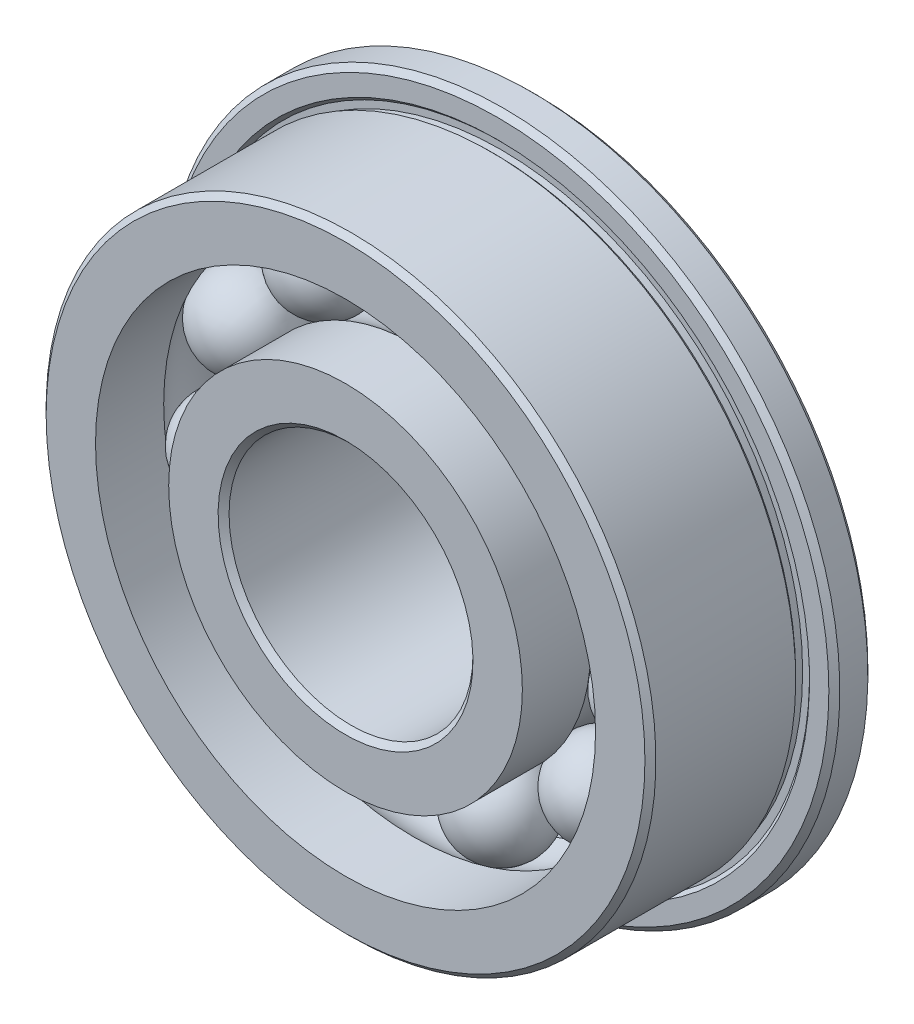
ISO-10303-21;
HEADER;
FILE_DESCRIPTION(('STEP AP214'),'2;1');
FILE_NAME('part.step','',(''),(''),'','','');
FILE_SCHEMA(('AUTOMOTIVE_DESIGN { 1 0 10303 214 1 1 1 1 }'));
ENDSEC;
DATA;
#1=APPLICATION_CONTEXT('core data for automotive mechanical design processes');
#2=APPLICATION_PROTOCOL_DEFINITION('international standard','automotive_design',2000,#1);
#3=PRODUCT_CONTEXT('',#1,'mechanical');
#4=PRODUCT('Part','Part','',(#3));
#5=PRODUCT_RELATED_PRODUCT_CATEGORY('part','',(#4));
#6=PRODUCT_DEFINITION_FORMATION('','',#4);
#7=PRODUCT_DEFINITION_CONTEXT('part definition',#1,'design');
#8=PRODUCT_DEFINITION('design','',#6,#7);
#9=PRODUCT_DEFINITION_SHAPE('','',#8);
#10=(LENGTH_UNIT() NAMED_UNIT(*) SI_UNIT(.MILLI.,.METRE.));
#11=(NAMED_UNIT(*) PLANE_ANGLE_UNIT() SI_UNIT($,.RADIAN.));
#12=(NAMED_UNIT(*) SI_UNIT($,.STERADIAN.) SOLID_ANGLE_UNIT());
#13=UNCERTAINTY_MEASURE_WITH_UNIT(LENGTH_MEASURE(1.E-05),#10,'distance_accuracy_value','');
#14=(GEOMETRIC_REPRESENTATION_CONTEXT(3) GLOBAL_UNCERTAINTY_ASSIGNED_CONTEXT((#13)) GLOBAL_UNIT_ASSIGNED_CONTEXT((#10,
#11,#12)) REPRESENTATION_CONTEXT('',''));
#15=CARTESIAN_POINT('',(0.,0.,0.));
#16=DIRECTION('',(0.,0.,1.));
#17=DIRECTION('',(1.,0.,0.));
#18=AXIS2_PLACEMENT_3D('',#15,#16,#17);
#19=CARTESIAN_POINT('',(-3.0039355419876,4.67421494179329,0.));
#20=DIRECTION('',(-0.540640817455586,0.841253532831188,0.));
#21=DIRECTION('',(0.841253532831188,0.540640817455586,0.));
#22=AXIS2_PLACEMENT_3D('',#19,#20,#21);
#23=SPHERICAL_SURFACE('',#22,1.190625);
#24=CARTESIAN_POINT('',(-3.64763601527066,5.67583242932043,0.));
#25=VERTEX_POINT('',#24);
#26=VERTEX_LOOP('',#25);
#27=FACE_BOUND('',#26,.T.);
#28=ADVANCED_FACE('F45',(#27),#23,.T.);
#29=CLOSED_SHELL('',(#28));
#30=MANIFOLD_SOLID_BREP('B2',#29);
#31=CARTESIAN_POINT('',(-5.05414277418852,2.30814966599179,0.));
#32=DIRECTION('',(-0.909631995354513,0.415415013001897,0.));
#33=DIRECTION('',(0.415415013001897,0.909631995354513,0.));
#34=AXIS2_PLACEMENT_3D('',#31,#32,#33);
#35=SPHERICAL_SURFACE('',#34,1.190625);
#36=CARTESIAN_POINT('',(-6.13717336865748,2.80275316584718,0.));
#37=VERTEX_POINT('',#36);
#38=VERTEX_LOOP('',#37);
#39=FACE_BOUND('',#38,.T.);
#40=ADVANCED_FACE('F65',(#39),#35,.T.);
#41=CLOSED_SHELL('',(#40));
#42=MANIFOLD_SOLID_BREP('B7',#41);
#43=CARTESIAN_POINT('',(-5.49969538645094,-0.790736820155883,0.));
#44=DIRECTION('',(-0.989821441880934,-0.142314838273275,0.));
#45=DIRECTION('',(-0.142314838273275,0.989821441880934,0.));
#46=AXIS2_PLACEMENT_3D('',#43,#44,#45);
#47=SPHERICAL_SURFACE('',#46,1.190625);
#48=CARTESIAN_POINT('',(-6.67820154069043,-0.960180424475,0.));
#49=VERTEX_POINT('',#48);
#50=VERTEX_LOOP('',#49);
#51=FACE_BOUND('',#50,.T.);
#52=ADVANCED_FACE('F85',(#51),#47,.T.);
#53=CLOSED_SHELL('',(#52));
#54=MANIFOLD_SOLID_BREP('B41',#53);
#55=CARTESIAN_POINT('',(-4.19913357250588,-3.63856995298345,0.));
#56=DIRECTION('',(-0.755749574354264,-0.654860733945278,0.));
#57=DIRECTION('',(-0.654860733945278,0.755749574354264,0.));
#58=AXIS2_PLACEMENT_3D('',#55,#56,#57);
#59=SPHERICAL_SURFACE('',#58,1.190625);
#60=CARTESIAN_POINT('',(-5.09894790947143,-4.41826351433705,0.));
#61=VERTEX_POINT('',#60);
#62=VERTEX_LOOP('',#61);
#63=FACE_BOUND('',#62,.T.);
#64=ADVANCED_FACE('F105',(#63),#59,.T.);
#65=CLOSED_SHELL('',(#64));
#66=MANIFOLD_SOLID_BREP('B61',#65);
#67=CARTESIAN_POINT('',(-1.56537651895024,-5.33118283464554,0.));
#68=DIRECTION('',(-0.281732556841437,-0.959492973614495,0.));
#69=DIRECTION('',(-0.959492973614495,0.281732556841437,0.));
#70=AXIS2_PLACEMENT_3D('',#67,#68,#69);
#71=SPHERICAL_SURFACE('',#70,1.190625);
#72=CARTESIAN_POINT('',(-1.90081434443957,-6.4735791563553,0.));
#73=VERTEX_POINT('',#72);
#74=VERTEX_LOOP('',#73);
#75=FACE_BOUND('',#74,.T.);
#76=ADVANCED_FACE('F125',(#75),#71,.T.);
#77=CLOSED_SHELL('',(#76));
#78=MANIFOLD_SOLID_BREP('B81',#77);
#79=CARTESIAN_POINT('',(1.56537651895016,-5.33118283464556,0.));
#80=DIRECTION('',(0.281732556841423,-0.959492973614499,0.));
#81=DIRECTION('',(-0.959492973614499,-0.281732556841423,0.));
#82=AXIS2_PLACEMENT_3D('',#79,#80,#81);
#83=SPHERICAL_SURFACE('',#82,1.190625);
#84=CARTESIAN_POINT('',(1.90081434443948,-6.47357915635533,0.));
#85=VERTEX_POINT('',#84);
#86=VERTEX_LOOP('',#85);
#87=FACE_BOUND('',#86,.T.);
#88=ADVANCED_FACE('F145',(#87),#83,.T.);
#89=CLOSED_SHELL('',(#88));
#90=MANIFOLD_SOLID_BREP('B101',#89);
#91=CARTESIAN_POINT('',(4.19913357250583,-3.63856995298351,0.));
#92=DIRECTION('',(0.755749574354255,-0.654860733945289,0.));
#93=DIRECTION('',(-0.654860733945289,-0.755749574354255,0.));
#94=AXIS2_PLACEMENT_3D('',#91,#92,#93);
#95=SPHERICAL_SURFACE('',#94,1.190625);
#96=CARTESIAN_POINT('',(5.09894790947136,-4.41826351433712,0.));
#97=VERTEX_POINT('',#96);
#98=VERTEX_LOOP('',#97);
#99=FACE_BOUND('',#98,.T.);
#100=ADVANCED_FACE('F165',(#99),#95,.T.);
#101=CLOSED_SHELL('',(#100));
#102=MANIFOLD_SOLID_BREP('B121',#101);
#103=CARTESIAN_POINT('',(5.49969538645093,-0.790736820155962,0.));
#104=DIRECTION('',(0.989821441880932,-0.142314838273289,0.));
#105=DIRECTION('',(-0.142314838273289,-0.989821441880932,0.));
#106=AXIS2_PLACEMENT_3D('',#103,#104,#105);
#107=SPHERICAL_SURFACE('',#106,1.190625);
#108=CARTESIAN_POINT('',(6.67820154069041,-0.960180424475096,0.));
#109=VERTEX_POINT('',#108);
#110=VERTEX_LOOP('',#109);
#111=FACE_BOUND('',#110,.T.);
#112=ADVANCED_FACE('F185',(#111),#107,.T.);
#113=CLOSED_SHELL('',(#112));
#114=MANIFOLD_SOLID_BREP('B141',#113);
#115=CARTESIAN_POINT('',(5.05414277418855,2.30814966599172,0.));
#116=DIRECTION('',(0.909631995354519,0.415415013001884,0.));
#117=DIRECTION('',(0.415415013001884,-0.909631995354519,0.));
#118=AXIS2_PLACEMENT_3D('',#115,#116,#117);
#119=SPHERICAL_SURFACE('',#118,1.190625);
#120=CARTESIAN_POINT('',(6.13717336865752,2.80275316584709,0.));
#121=VERTEX_POINT('',#120);
#122=VERTEX_LOOP('',#121);
#123=FACE_BOUND('',#122,.T.);
#124=ADVANCED_FACE('F205',(#123),#119,.T.);
#125=CLOSED_SHELL('',(#124));
#126=MANIFOLD_SOLID_BREP('B161',#125);
#127=CARTESIAN_POINT('',(3.00393554198767,4.67421494179325,0.));
#128=DIRECTION('',(0.540640817455599,0.841253532831181,0.));
#129=DIRECTION('',(0.841253532831181,-0.540640817455599,0.));
#130=AXIS2_PLACEMENT_3D('',#127,#128,#129);
#131=SPHERICAL_SURFACE('',#130,1.190625);
#132=CARTESIAN_POINT('',(3.64763601527074,5.67583242932037,0.));
#133=VERTEX_POINT('',#132);
#134=VERTEX_LOOP('',#133);
#135=FACE_BOUND('',#134,.T.);
#136=ADVANCED_FACE('F225',(#135),#131,.T.);
#137=CLOSED_SHELL('',(#136));
#138=MANIFOLD_SOLID_BREP('B181',#137);
#139=CARTESIAN_POINT('',(0.,5.55625,0.));
#140=DIRECTION('',(0.,1.,0.));
#141=DIRECTION('',(1.,0.,0.));
#142=AXIS2_PLACEMENT_3D('',#139,#140,#141);
#143=SPHERICAL_SURFACE('',#142,1.190625);
#144=CARTESIAN_POINT('',(0.,6.746875,0.));
#145=VERTEX_POINT('',#144);
#146=VERTEX_LOOP('',#145);
#147=FACE_BOUND('',#146,.T.);
#148=ADVANCED_FACE('F248',(#147),#143,.T.);
#149=CLOSED_SHELL('',(#148));
#150=MANIFOLD_SOLID_BREP('B201',#149);
#151=CARTESIAN_POINT('',(0.,0.,0.));
#152=DIRECTION('',(0.,0.,1.));
#153=DIRECTION('',(0.,-1.,0.));
#154=AXIS2_PLACEMENT_3D('',#151,#152,#153);
#155=CYLINDRICAL_SURFACE('',#154,4.60375);
#156=CARTESIAN_POINT('',(0.,0.,-0.714374999999998));
#157=DIRECTION('',(0.,0.,1.));
#158=DIRECTION('',(0.,-1.,0.));
#159=AXIS2_PLACEMENT_3D('',#156,#157,#158);
#160=CIRCLE('',#159,4.60375);
#161=CARTESIAN_POINT('',(0.,-4.60375,-0.714374999999999));
#162=VERTEX_POINT('',#161);
#163=EDGE_CURVE('E297',#162,#162,#160,.T.);
#164=ORIENTED_EDGE('',*,*,#163,.F.);
#165=EDGE_LOOP('',(#164));
#166=FACE_BOUND('',#165,.T.);
#167=CARTESIAN_POINT('',(0.,0.,-2.4892));
#168=DIRECTION('',(0.,0.,1.));
#169=DIRECTION('',(0.,-1.,0.));
#170=AXIS2_PLACEMENT_3D('',#167,#168,#169);
#171=CIRCLE('',#170,4.60375);
#172=CARTESIAN_POINT('',(0.,-4.60375,-2.4892));
#173=VERTEX_POINT('',#172);
#174=EDGE_CURVE('E309',#173,#173,#171,.T.);
#175=ORIENTED_EDGE('',*,*,#174,.T.);
#176=EDGE_LOOP('',(#175));
#177=FACE_BOUND('',#176,.T.);
#178=ADVANCED_FACE('F271',(#166,#177),#155,.T.);
#179=CARTESIAN_POINT('',(0.,0.,0.));
#180=DIRECTION('',(0.,0.,1.));
#181=DIRECTION('',(0.,-1.,0.));
#182=AXIS2_PLACEMENT_3D('',#179,#180,#181);
#183=TOROIDAL_SURFACE('',#182,5.55625,1.190625);
#184=CARTESIAN_POINT('',(0.,0.,0.714374999999999));
#185=DIRECTION('',(0.,0.,1.));
#186=DIRECTION('',(0.,-1.,0.));
#187=AXIS2_PLACEMENT_3D('',#184,#185,#186);
#188=CIRCLE('',#187,4.60375);
#189=CARTESIAN_POINT('',(0.,-4.60375,0.714374999999998));
#190=VERTEX_POINT('',#189);
#191=EDGE_CURVE('E301',#190,#190,#188,.T.);
#192=ORIENTED_EDGE('',*,*,#191,.F.);
#193=EDGE_LOOP('',(#192));
#194=FACE_BOUND('',#193,.T.);
#195=ORIENTED_EDGE('',*,*,#163,.T.);
#196=EDGE_LOOP('',(#195));
#197=FACE_BOUND('',#196,.T.);
#198=ADVANCED_FACE('F330',(#194,#197),#183,.F.);
#199=CARTESIAN_POINT('',(0.,0.,0.));
#200=DIRECTION('',(0.,0.,1.));
#201=DIRECTION('',(0.,-1.,0.));
#202=AXIS2_PLACEMENT_3D('',#199,#200,#201);
#203=CYLINDRICAL_SURFACE('',#202,4.60375);
#204=CARTESIAN_POINT('',(0.,0.,2.4892));
#205=DIRECTION('',(0.,0.,1.));
#206=DIRECTION('',(0.,-1.,0.));
#207=AXIS2_PLACEMENT_3D('',#204,#205,#206);
#208=CIRCLE('',#207,4.60375);
#209=CARTESIAN_POINT('',(0.,-4.60375,2.4892));
#210=VERTEX_POINT('',#209);
#211=EDGE_CURVE('E305',#210,#210,#208,.T.);
#212=ORIENTED_EDGE('',*,*,#211,.F.);
#213=EDGE_LOOP('',(#212));
#214=FACE_BOUND('',#213,.T.);
#215=ORIENTED_EDGE('',*,*,#191,.T.);
#216=EDGE_LOOP('',(#215));
#217=FACE_BOUND('',#216,.T.);
#218=ADVANCED_FACE('F336',(#214,#217),#203,.T.);
#219=CARTESIAN_POINT('',(0.,3.175,2.4892));
#220=DIRECTION('',(0.,0.,-1.));
#221=DIRECTION('',(0.,1.,0.));
#222=AXIS2_PLACEMENT_3D('',#219,#220,#221);
#223=PLANE('',#222);
#224=CARTESIAN_POINT('',(0.,0.,2.4892));
#225=DIRECTION('',(0.,0.,-1.));
#226=DIRECTION('',(0.,1.,0.));
#227=AXIS2_PLACEMENT_3D('',#224,#225,#226);
#228=CIRCLE('',#227,3.317875);
#229=CARTESIAN_POINT('',(0.,3.317875,2.4892));
#230=VERTEX_POINT('',#229);
#231=EDGE_CURVE('E247',#230,#230,#228,.T.);
#232=ORIENTED_EDGE('',*,*,#231,.T.);
#233=EDGE_LOOP('',(#232));
#234=FACE_BOUND('',#233,.T.);
#235=ORIENTED_EDGE('',*,*,#211,.T.);
#236=EDGE_LOOP('',(#235));
#237=FACE_BOUND('',#236,.T.);
#238=ADVANCED_FACE('F327',(#234,#237),#223,.F.);
#239=CARTESIAN_POINT('',(0.,0.,0.));
#240=DIRECTION('',(0.,0.,1.));
#241=DIRECTION('',(0.,-1.,0.));
#242=AXIS2_PLACEMENT_3D('',#239,#240,#241);
#243=CYLINDRICAL_SURFACE('',#242,3.175);
#244=CARTESIAN_POINT('',(0.,0.,-2.346325));
#245=DIRECTION('',(0.,0.,1.));
#246=DIRECTION('',(0.,-1.,0.));
#247=AXIS2_PLACEMENT_3D('',#244,#245,#246);
#248=CIRCLE('',#247,3.175);
#249=CARTESIAN_POINT('',(0.,-3.175,-2.346325));
#250=VERTEX_POINT('',#249);
#251=EDGE_CURVE('E279',#250,#250,#248,.F.);
#252=ORIENTED_EDGE('',*,*,#251,.T.);
#253=EDGE_LOOP('',(#252));
#254=FACE_BOUND('',#253,.T.);
#255=CARTESIAN_POINT('',(0.,0.,2.346325));
#256=DIRECTION('',(0.,0.,-1.));
#257=DIRECTION('',(0.,1.,0.));
#258=AXIS2_PLACEMENT_3D('',#255,#256,#257);
#259=CIRCLE('',#258,3.175);
#260=CARTESIAN_POINT('',(0.,3.175,2.346325));
#261=VERTEX_POINT('',#260);
#262=EDGE_CURVE('E285',#261,#261,#259,.F.);
#263=ORIENTED_EDGE('',*,*,#262,.T.);
#264=EDGE_LOOP('',(#263));
#265=FACE_BOUND('',#264,.T.);
#266=ADVANCED_FACE('F319',(#254,#265),#243,.F.);
#267=CARTESIAN_POINT('',(0.,4.60375,-2.4892));
#268=DIRECTION('',(0.,0.,1.));
#269=DIRECTION('',(0.,-1.,0.));
#270=AXIS2_PLACEMENT_3D('',#267,#268,#269);
#271=PLANE('',#270);
#272=CARTESIAN_POINT('',(0.,0.,-2.4892));
#273=DIRECTION('',(0.,0.,1.));
#274=DIRECTION('',(0.,-1.,0.));
#275=AXIS2_PLACEMENT_3D('',#272,#273,#274);
#276=CIRCLE('',#275,3.317875);
#277=CARTESIAN_POINT('',(0.,-3.317875,-2.4892));
#278=VERTEX_POINT('',#277);
#279=EDGE_CURVE('E291',#278,#278,#276,.T.);
#280=ORIENTED_EDGE('',*,*,#279,.T.);
#281=EDGE_LOOP('',(#280));
#282=FACE_BOUND('',#281,.T.);
#283=ORIENTED_EDGE('',*,*,#174,.F.);
#284=EDGE_LOOP('',(#283));
#285=FACE_BOUND('',#284,.T.);
#286=ADVANCED_FACE('F316',(#282,#285),#271,.F.);
#287=CARTESIAN_POINT('',(0.,0.,-2.4892));
#288=DIRECTION('',(0.,0.,-1.));
#289=DIRECTION('',(0.,1.,0.));
#290=AXIS2_PLACEMENT_3D('',#287,#288,#289);
#291=CONICAL_SURFACE('',#290,3.317875,0.785398163397448);
#292=ORIENTED_EDGE('',*,*,#251,.F.);
#293=EDGE_LOOP('',(#292));
#294=FACE_BOUND('',#293,.T.);
#295=ORIENTED_EDGE('',*,*,#279,.F.);
#296=EDGE_LOOP('',(#295));
#297=FACE_BOUND('',#296,.T.);
#298=ADVANCED_FACE('F318',(#294,#297),#291,.F.);
#299=CARTESIAN_POINT('',(0.,0.,2.346325));
#300=DIRECTION('',(0.,0.,1.));
#301=DIRECTION('',(0.,-1.,0.));
#302=AXIS2_PLACEMENT_3D('',#299,#300,#301);
#303=CONICAL_SURFACE('',#302,3.175,0.78539816339745);
#304=ORIENTED_EDGE('',*,*,#231,.F.);
#305=EDGE_LOOP('',(#304));
#306=FACE_BOUND('',#305,.T.);
#307=ORIENTED_EDGE('',*,*,#262,.F.);
#308=EDGE_LOOP('',(#307));
#309=FACE_BOUND('',#308,.T.);
#310=ADVANCED_FACE('F273',(#306,#309),#303,.F.);
#311=CLOSED_SHELL('',(#178,#198,#218,#238,#266,#286,#298,#310));
#312=MANIFOLD_SOLID_BREP('B221',#311);
#313=CARTESIAN_POINT('',(0.,6.50875,-2.4892));
#314=DIRECTION('',(0.,0.,1.));
#315=DIRECTION('',(0.,-1.,0.));
#316=AXIS2_PLACEMENT_3D('',#313,#314,#315);
#317=PLANE('',#316);
#318=CARTESIAN_POINT('',(0.,0.,-2.4892));
#319=DIRECTION('',(0.,0.,1.));
#320=DIRECTION('',(0.,-1.,0.));
#321=AXIS2_PLACEMENT_3D('',#318,#319,#320);
#322=CIRCLE('',#321,8.620125);
#323=CARTESIAN_POINT('',(0.,-8.620125,-2.4892));
#324=VERTEX_POINT('',#323);
#325=EDGE_CURVE('E445',#324,#324,#322,.F.);
#326=ORIENTED_EDGE('',*,*,#325,.T.);
#327=EDGE_LOOP('',(#326));
#328=FACE_BOUND('',#327,.T.);
#329=CARTESIAN_POINT('',(0.,0.,-2.4892));
#330=DIRECTION('',(0.,0.,1.));
#331=DIRECTION('',(0.,-1.,0.));
#332=AXIS2_PLACEMENT_3D('',#329,#330,#331);
#333=CIRCLE('',#332,6.50875);
#334=CARTESIAN_POINT('',(0.,-6.50875,-2.4892));
#335=VERTEX_POINT('',#334);
#336=EDGE_CURVE('E459',#335,#335,#333,.T.);
#337=ORIENTED_EDGE('',*,*,#336,.T.);
#338=EDGE_LOOP('',(#337));
#339=FACE_BOUND('',#338,.T.);
#340=ADVANCED_FACE('F425',(#328,#339),#317,.F.);
#341=CARTESIAN_POINT('',(0.,0.,0.));
#342=DIRECTION('',(0.,0.,1.));
#343=DIRECTION('',(0.,-1.,0.));
#344=AXIS2_PLACEMENT_3D('',#341,#342,#343);
#345=CYLINDRICAL_SURFACE('',#344,6.50875);
#346=ORIENTED_EDGE('',*,*,#336,.F.);
#347=EDGE_LOOP('',(#346));
#348=FACE_BOUND('',#347,.T.);
#349=CARTESIAN_POINT('',(0.,0.,-0.714374999999999));
#350=DIRECTION('',(0.,0.,1.));
#351=DIRECTION('',(0.,-1.,0.));
#352=AXIS2_PLACEMENT_3D('',#349,#350,#351);
#353=CIRCLE('',#352,6.50875);
#354=CARTESIAN_POINT('',(0.,-6.50875,-0.714374999999999));
#355=VERTEX_POINT('',#354);
#356=EDGE_CURVE('E463',#355,#355,#353,.T.);
#357=ORIENTED_EDGE('',*,*,#356,.T.);
#358=EDGE_LOOP('',(#357));
#359=FACE_BOUND('',#358,.T.);
#360=ADVANCED_FACE('F515',(#348,#359),#345,.F.);
#361=CARTESIAN_POINT('',(0.,0.,0.));
#362=DIRECTION('',(0.,0.,1.));
#363=DIRECTION('',(0.,-1.,0.));
#364=AXIS2_PLACEMENT_3D('',#361,#362,#363);
#365=TOROIDAL_SURFACE('',#364,5.55625,1.190625);
#366=ORIENTED_EDGE('',*,*,#356,.F.);
#367=EDGE_LOOP('',(#366));
#368=FACE_BOUND('',#367,.T.);
#369=CARTESIAN_POINT('',(0.,0.,0.714374999999999));
#370=DIRECTION('',(0.,0.,1.));
#371=DIRECTION('',(0.,-1.,0.));
#372=AXIS2_PLACEMENT_3D('',#369,#370,#371);
#373=CIRCLE('',#372,6.50875);
#374=CARTESIAN_POINT('',(0.,-6.50875,0.714374999999998));
#375=VERTEX_POINT('',#374);
#376=EDGE_CURVE('E467',#375,#375,#373,.T.);
#377=ORIENTED_EDGE('',*,*,#376,.T.);
#378=EDGE_LOOP('',(#377));
#379=FACE_BOUND('',#378,.T.);
#380=ADVANCED_FACE('F521',(#368,#379),#365,.F.);
#381=CARTESIAN_POINT('',(0.,0.,0.));
#382=DIRECTION('',(0.,0.,1.));
#383=DIRECTION('',(0.,-1.,0.));
#384=AXIS2_PLACEMENT_3D('',#381,#382,#383);
#385=CYLINDRICAL_SURFACE('',#384,6.50875);
#386=ORIENTED_EDGE('',*,*,#376,.F.);
#387=EDGE_LOOP('',(#386));
#388=FACE_BOUND('',#387,.T.);
#389=CARTESIAN_POINT('',(0.,0.,2.4892));
#390=DIRECTION('',(0.,0.,1.));
#391=DIRECTION('',(0.,-1.,0.));
#392=AXIS2_PLACEMENT_3D('',#389,#390,#391);
#393=CIRCLE('',#392,6.50875);
#394=CARTESIAN_POINT('',(0.,-6.50875,2.4892));
#395=VERTEX_POINT('',#394);
#396=EDGE_CURVE('E471',#395,#395,#393,.T.);
#397=ORIENTED_EDGE('',*,*,#396,.T.);
#398=EDGE_LOOP('',(#397));
#399=FACE_BOUND('',#398,.T.);
#400=ADVANCED_FACE('F619',(#388,#399),#385,.F.);
#401=CARTESIAN_POINT('',(0.,7.9375,2.4892));
#402=DIRECTION('',(0.,0.,-1.));
#403=DIRECTION('',(0.,1.,0.));
#404=AXIS2_PLACEMENT_3D('',#401,#402,#403);
#405=PLANE('',#404);
#406=CARTESIAN_POINT('',(0.,0.,2.4892));
#407=DIRECTION('',(0.,0.,-1.));
#408=DIRECTION('',(0.,1.,0.));
#409=AXIS2_PLACEMENT_3D('',#406,#407,#408);
#410=CIRCLE('',#409,7.794625);
#411=CARTESIAN_POINT('',(0.,7.794625,2.4892));
#412=VERTEX_POINT('',#411);
#413=EDGE_CURVE('E433',#412,#412,#410,.F.);
#414=ORIENTED_EDGE('',*,*,#413,.T.);
#415=EDGE_LOOP('',(#414));
#416=FACE_BOUND('',#415,.T.);
#417=ORIENTED_EDGE('',*,*,#396,.F.);
#418=EDGE_LOOP('',(#417));
#419=FACE_BOUND('',#418,.T.);
#420=ADVANCED_FACE('F610',(#416,#419),#405,.F.);
#421=CARTESIAN_POINT('',(0.,0.,0.));
#422=DIRECTION('',(0.,0.,1.));
#423=DIRECTION('',(0.,-1.,0.));
#424=AXIS2_PLACEMENT_3D('',#421,#422,#423);
#425=CYLINDRICAL_SURFACE('',#424,7.9375);
#426=CARTESIAN_POINT('',(0.,0.,2.346325));
#427=DIRECTION('',(0.,0.,-1.));
#428=DIRECTION('',(0.,1.,0.));
#429=AXIS2_PLACEMENT_3D('',#426,#427,#428);
#430=CIRCLE('',#429,7.9375);
#431=CARTESIAN_POINT('',(0.,7.9375,2.346325));
#432=VERTEX_POINT('',#431);
#433=EDGE_CURVE('E270',#432,#432,#430,.T.);
#434=ORIENTED_EDGE('',*,*,#433,.T.);
#435=EDGE_LOOP('',(#434));
#436=FACE_BOUND('',#435,.T.);
#437=CARTESIAN_POINT('',(0.,0.,-1.29359487757862));
#438=DIRECTION('',(0.,0.,1.));
#439=DIRECTION('',(0.,-1.,0.));
#440=AXIS2_PLACEMENT_3D('',#437,#438,#439);
#441=CIRCLE('',#440,7.9375);
#442=CARTESIAN_POINT('',(0.,-7.9375,-1.29359487757862));
#443=VERTEX_POINT('',#442);
#444=EDGE_CURVE('E475',#443,#443,#441,.T.);
#445=ORIENTED_EDGE('',*,*,#444,.T.);
#446=EDGE_LOOP('',(#445));
#447=FACE_BOUND('',#446,.T.);
#448=ADVANCED_FACE('F600',(#436,#447),#425,.T.);
#449=CARTESIAN_POINT('',(0.,0.,-1.38339743878931));
#450=DIRECTION('',(0.,0.,1.));
#451=DIRECTION('',(0.,-1.,0.));
#452=AXIS2_PLACEMENT_3D('',#449,#450,#451);
#453=CONICAL_SURFACE('',#452,7.84769743878931,0.785398163397442);
#454=ORIENTED_EDGE('',*,*,#444,.F.);
#455=EDGE_LOOP('',(#454));
#456=FACE_BOUND('',#455,.T.);
#457=CARTESIAN_POINT('',(0.,0.,-1.38339743878931));
#458=DIRECTION('',(0.,0.,1.));
#459=DIRECTION('',(0.,-1.,0.));
#460=AXIS2_PLACEMENT_3D('',#457,#458,#459);
#461=CIRCLE('',#460,7.84769743878931);
#462=CARTESIAN_POINT('',(0.,-7.84769743878931,-1.38339743878931));
#463=VERTEX_POINT('',#462);
#464=EDGE_CURVE('E479',#463,#463,#461,.T.);
#465=ORIENTED_EDGE('',*,*,#464,.T.);
#466=EDGE_LOOP('',(#465));
#467=FACE_BOUND('',#466,.T.);
#468=ADVANCED_FACE('F590',(#456,#467),#453,.T.);
#469=CARTESIAN_POINT('',(0.,0.,0.));
#470=DIRECTION('',(0.,0.,1.));
#471=DIRECTION('',(0.,-1.,0.));
#472=AXIS2_PLACEMENT_3D('',#469,#470,#471);
#473=CYLINDRICAL_SURFACE('',#472,7.84769743878931);
#474=ORIENTED_EDGE('',*,*,#464,.F.);
#475=EDGE_LOOP('',(#474));
#476=FACE_BOUND('',#475,.T.);
#477=CARTESIAN_POINT('',(0.,0.,-1.56300256121069));
#478=DIRECTION('',(0.,0.,1.));
#479=DIRECTION('',(0.,-1.,0.));
#480=AXIS2_PLACEMENT_3D('',#477,#478,#479);
#481=CIRCLE('',#480,7.84769743878931);
#482=CARTESIAN_POINT('',(0.,-7.84769743878931,-1.5630025612107));
#483=VERTEX_POINT('',#482);
#484=EDGE_CURVE('E483',#483,#483,#481,.T.);
#485=ORIENTED_EDGE('',*,*,#484,.T.);
#486=EDGE_LOOP('',(#485));
#487=FACE_BOUND('',#486,.T.);
#488=ADVANCED_FACE('F580',(#476,#487),#473,.T.);
#489=CARTESIAN_POINT('',(0.,8.02730256121069,-1.56300256121069));
#490=DIRECTION('',(0.,0.,-1.));
#491=DIRECTION('',(0.,1.,0.));
#492=AXIS2_PLACEMENT_3D('',#489,#490,#491);
#493=PLANE('',#492);
#494=ORIENTED_EDGE('',*,*,#484,.F.);
#495=EDGE_LOOP('',(#494));
#496=FACE_BOUND('',#495,.T.);
#497=CARTESIAN_POINT('',(0.,0.,-1.56300256121069));
#498=DIRECTION('',(0.,0.,1.));
#499=DIRECTION('',(0.,-1.,0.));
#500=AXIS2_PLACEMENT_3D('',#497,#498,#499);
#501=CIRCLE('',#500,8.02730256121069);
#502=CARTESIAN_POINT('',(0.,-8.02730256121069,-1.56300256121069));
#503=VERTEX_POINT('',#502);
#504=EDGE_CURVE('E487',#503,#503,#501,.T.);
#505=ORIENTED_EDGE('',*,*,#504,.T.);
#506=EDGE_LOOP('',(#505));
#507=FACE_BOUND('',#506,.T.);
#508=ADVANCED_FACE('F511',(#496,#507),#493,.F.);
#509=CARTESIAN_POINT('',(0.,0.,-1.4732));
#510=DIRECTION('',(0.,0.,1.));
#511=DIRECTION('',(0.,-1.,0.));
#512=AXIS2_PLACEMENT_3D('',#509,#510,#511);
#513=CONICAL_SURFACE('',#512,8.11710512242138,0.785398163397445);
#514=ORIENTED_EDGE('',*,*,#504,.F.);
#515=EDGE_LOOP('',(#514));
#516=FACE_BOUND('',#515,.T.);
#517=CARTESIAN_POINT('',(0.,0.,-1.4732));
#518=DIRECTION('',(0.,0.,1.));
#519=DIRECTION('',(0.,-1.,0.));
#520=AXIS2_PLACEMENT_3D('',#517,#518,#519);
#521=CIRCLE('',#520,8.11710512242138);
#522=CARTESIAN_POINT('',(0.,-8.11710512242138,-1.4732));
#523=VERTEX_POINT('',#522);
#524=EDGE_CURVE('E491',#523,#523,#521,.T.);
#525=ORIENTED_EDGE('',*,*,#524,.T.);
#526=EDGE_LOOP('',(#525));
#527=FACE_BOUND('',#526,.T.);
#528=ADVANCED_FACE('F497',(#516,#527),#513,.F.);
#529=CARTESIAN_POINT('',(0.,8.763,-1.4732));
#530=DIRECTION('',(0.,0.,-1.));
#531=DIRECTION('',(0.,1.,0.));
#532=AXIS2_PLACEMENT_3D('',#529,#530,#531);
#533=PLANE('',#532);
#534=CARTESIAN_POINT('',(0.,0.,-1.4732));
#535=DIRECTION('',(0.,0.,-1.));
#536=DIRECTION('',(0.,1.,0.));
#537=AXIS2_PLACEMENT_3D('',#534,#535,#536);
#538=CIRCLE('',#537,8.620125);
#539=CARTESIAN_POINT('',(0.,8.620125,-1.4732));
#540=VERTEX_POINT('',#539);
#541=EDGE_CURVE('E439',#540,#540,#538,.F.);
#542=ORIENTED_EDGE('',*,*,#541,.T.);
#543=EDGE_LOOP('',(#542));
#544=FACE_BOUND('',#543,.T.);
#545=ORIENTED_EDGE('',*,*,#524,.F.);
#546=EDGE_LOOP('',(#545));
#547=FACE_BOUND('',#546,.T.);
#548=ADVANCED_FACE('F499',(#544,#547),#533,.F.);
#549=CARTESIAN_POINT('',(0.,0.,0.));
#550=DIRECTION('',(0.,0.,1.));
#551=DIRECTION('',(0.,-1.,0.));
#552=AXIS2_PLACEMENT_3D('',#549,#550,#551);
#553=CYLINDRICAL_SURFACE('',#552,8.763);
#554=CARTESIAN_POINT('',(0.,0.,-2.346325));
#555=DIRECTION('',(0.,0.,1.));
#556=DIRECTION('',(0.,-1.,0.));
#557=AXIS2_PLACEMENT_3D('',#554,#555,#556);
#558=CIRCLE('',#557,8.763);
#559=CARTESIAN_POINT('',(0.,-8.763,-2.346325));
#560=VERTEX_POINT('',#559);
#561=EDGE_CURVE('E451',#560,#560,#558,.T.);
#562=ORIENTED_EDGE('',*,*,#561,.T.);
#563=EDGE_LOOP('',(#562));
#564=FACE_BOUND('',#563,.T.);
#565=CARTESIAN_POINT('',(0.,0.,-1.616075));
#566=DIRECTION('',(0.,0.,-1.));
#567=DIRECTION('',(0.,1.,0.));
#568=AXIS2_PLACEMENT_3D('',#565,#566,#567);
#569=CIRCLE('',#568,8.763);
#570=CARTESIAN_POINT('',(0.,8.763,-1.616075));
#571=VERTEX_POINT('',#570);
#572=EDGE_CURVE('E455',#571,#571,#569,.T.);
#573=ORIENTED_EDGE('',*,*,#572,.T.);
#574=EDGE_LOOP('',(#573));
#575=FACE_BOUND('',#574,.T.);
#576=ADVANCED_FACE('F501',(#564,#575),#553,.T.);
#577=CARTESIAN_POINT('',(0.,0.,-2.346325));
#578=DIRECTION('',(0.,0.,1.));
#579=DIRECTION('',(0.,-1.,0.));
#580=AXIS2_PLACEMENT_3D('',#577,#578,#579);
#581=CONICAL_SURFACE('',#580,8.763,0.785398163397451);
#582=ORIENTED_EDGE('',*,*,#325,.F.);
#583=EDGE_LOOP('',(#582));
#584=FACE_BOUND('',#583,.T.);
#585=ORIENTED_EDGE('',*,*,#561,.F.);
#586=EDGE_LOOP('',(#585));
#587=FACE_BOUND('',#586,.T.);
#588=ADVANCED_FACE('F508',(#584,#587),#581,.T.);
#589=CARTESIAN_POINT('',(0.,0.,-1.4732));
#590=DIRECTION('',(0.,0.,-1.));
#591=DIRECTION('',(0.,1.,0.));
#592=AXIS2_PLACEMENT_3D('',#589,#590,#591);
#593=CONICAL_SURFACE('',#592,8.620125,0.785398163397451);
#594=ORIENTED_EDGE('',*,*,#572,.F.);
#595=EDGE_LOOP('',(#594));
#596=FACE_BOUND('',#595,.T.);
#597=ORIENTED_EDGE('',*,*,#541,.F.);
#598=EDGE_LOOP('',(#597));
#599=FACE_BOUND('',#598,.T.);
#600=ADVANCED_FACE('F528',(#596,#599),#593,.T.);
#601=CARTESIAN_POINT('',(0.,0.,2.4892));
#602=DIRECTION('',(0.,0.,-1.));
#603=DIRECTION('',(0.,1.,0.));
#604=AXIS2_PLACEMENT_3D('',#601,#602,#603);
#605=CONICAL_SURFACE('',#604,7.794625,0.785398163397448);
#606=ORIENTED_EDGE('',*,*,#433,.F.);
#607=EDGE_LOOP('',(#606));
#608=FACE_BOUND('',#607,.T.);
#609=ORIENTED_EDGE('',*,*,#413,.F.);
#610=EDGE_LOOP('',(#609));
#611=FACE_BOUND('',#610,.T.);
#612=ADVANCED_FACE('F427',(#608,#611),#605,.T.);
#613=CLOSED_SHELL('',(#340,#360,#380,#400,#420,#448,#468,#488,#508,#528,#548,#576,#588,#600,#612));
#614=MANIFOLD_SOLID_BREP('B242',#613);
#615=ADVANCED_BREP_SHAPE_REPRESENTATION('',(#18,#30,#42,#54,#66,#78,#90,#102,#114,#126,#138,
#150,#312,#614),#14);
#616=SHAPE_DEFINITION_REPRESENTATION(#9,#615);
ENDSEC;
END-ISO-10303-21;
